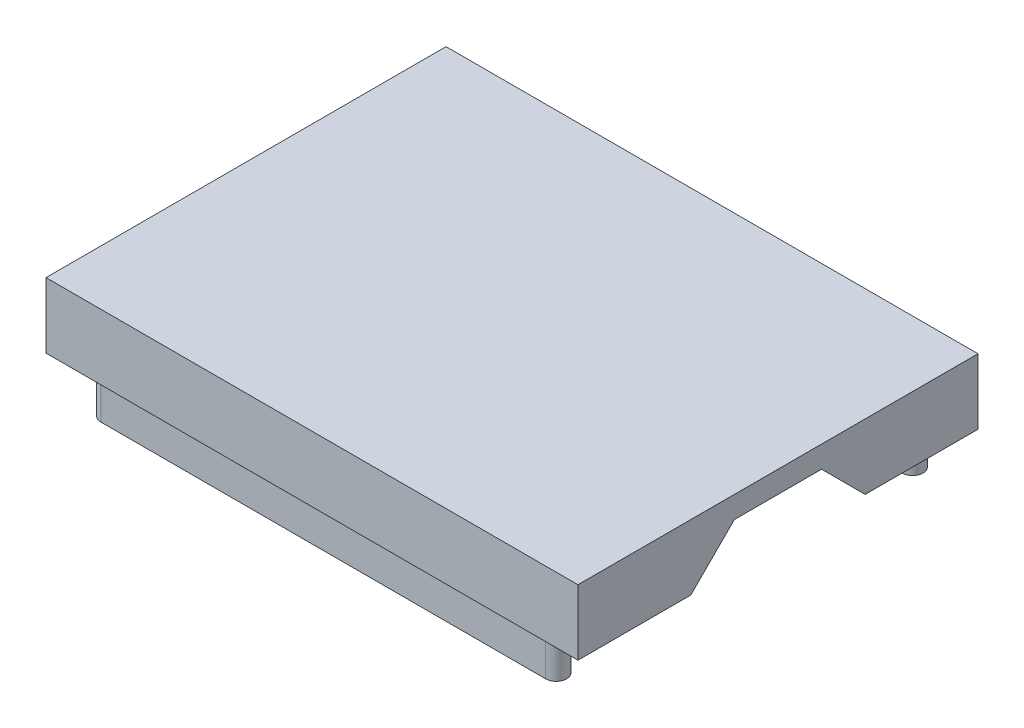
ISO-10303-21;
HEADER;
FILE_DESCRIPTION(('STEP AP214'),'2;1');
FILE_NAME('part.step','',(''),(''),'','','');
FILE_SCHEMA(('AUTOMOTIVE_DESIGN { 1 0 10303 214 1 1 1 1 }'));
ENDSEC;
DATA;
#1=APPLICATION_CONTEXT('core data for automotive mechanical design processes');
#2=APPLICATION_PROTOCOL_DEFINITION('international standard','automotive_design',2000,#1);
#3=PRODUCT_CONTEXT('',#1,'mechanical');
#4=PRODUCT('Part','Part','',(#3));
#5=PRODUCT_RELATED_PRODUCT_CATEGORY('part','',(#4));
#6=PRODUCT_DEFINITION_FORMATION('','',#4);
#7=PRODUCT_DEFINITION_CONTEXT('part definition',#1,'design');
#8=PRODUCT_DEFINITION('design','',#6,#7);
#9=PRODUCT_DEFINITION_SHAPE('','',#8);
#10=(LENGTH_UNIT() NAMED_UNIT(*) SI_UNIT(.MILLI.,.METRE.));
#11=(NAMED_UNIT(*) PLANE_ANGLE_UNIT() SI_UNIT($,.RADIAN.));
#12=(NAMED_UNIT(*) SI_UNIT($,.STERADIAN.) SOLID_ANGLE_UNIT());
#13=UNCERTAINTY_MEASURE_WITH_UNIT(LENGTH_MEASURE(1.E-05),#10,'distance_accuracy_value','');
#14=(GEOMETRIC_REPRESENTATION_CONTEXT(3) GLOBAL_UNCERTAINTY_ASSIGNED_CONTEXT((#13)) GLOBAL_UNIT_ASSIGNED_CONTEXT((#10,
#11,#12)) REPRESENTATION_CONTEXT('',''));
#15=CARTESIAN_POINT('',(0.,0.,0.));
#16=DIRECTION('',(0.,0.,1.));
#17=DIRECTION('',(1.,0.,0.));
#18=AXIS2_PLACEMENT_3D('',#15,#16,#17);
#19=CARTESIAN_POINT('',(1.27,0.,-6.57225));
#20=DIRECTION('',(0.,0.707106781186547,0.707106781186548));
#21=DIRECTION('',(0.,-0.707106781186548,0.707106781186547));
#22=AXIS2_PLACEMENT_3D('',#19,#20,#21);
#23=PLANE('',#22);
#24=DIRECTION('',(1.,0.,0.));
#25=VECTOR('',#24,1.);
#26=CARTESIAN_POINT('',(1.27,2.54,-9.11225));
#27=LINE('',#26,#25);
#28=CARTESIAN_POINT('',(1.27,2.54,-9.11225));
#29=VERTEX_POINT('',#28);
#30=CARTESIAN_POINT('',(2.54,2.54,-9.11225));
#31=VERTEX_POINT('',#30);
#32=EDGE_CURVE('E334',#29,#31,#27,.T.);
#33=ORIENTED_EDGE('',*,*,#32,.T.);
#34=DIRECTION('',(0.,-0.707106781186548,0.707106781186547));
#35=VECTOR('',#34,1.);
#36=CARTESIAN_POINT('',(2.54,0.,-6.57225));
#37=LINE('',#36,#35);
#38=CARTESIAN_POINT('',(2.54,0.,-6.57225));
#39=VERTEX_POINT('',#38);
#40=EDGE_CURVE('E247',#31,#39,#37,.T.);
#41=ORIENTED_EDGE('',*,*,#40,.T.);
#42=DIRECTION('',(1.,0.,0.));
#43=VECTOR('',#42,1.);
#44=CARTESIAN_POINT('',(1.27,0.,-6.57225));
#45=LINE('',#44,#43);
#46=CARTESIAN_POINT('',(1.27,0.,-6.57225));
#47=VERTEX_POINT('',#46);
#48=EDGE_CURVE('E329',#47,#39,#45,.T.);
#49=ORIENTED_EDGE('',*,*,#48,.F.);
#50=DIRECTION('',(0.,-0.707106781186548,0.707106781186547));
#51=VECTOR('',#50,1.);
#52=CARTESIAN_POINT('',(1.27,0.,-6.57225));
#53=LINE('',#52,#51);
#54=EDGE_CURVE('E319',#29,#47,#53,.T.);
#55=ORIENTED_EDGE('',*,*,#54,.F.);
#56=EDGE_LOOP('',(#33,#41,#49,#55));
#57=FACE_BOUND('',#56,.T.);
#58=ADVANCED_FACE('F41',(#57),#23,.F.);
#59=CARTESIAN_POINT('',(1.27,2.54,-14.19225));
#60=DIRECTION('',(0.,0.707106781186548,-0.707106781186547));
#61=DIRECTION('',(0.,0.707106781186547,0.707106781186548));
#62=AXIS2_PLACEMENT_3D('',#59,#60,#61);
#63=PLANE('',#62);
#64=DIRECTION('',(1.,0.,0.));
#65=VECTOR('',#64,1.);
#66=CARTESIAN_POINT('',(1.27,0.,-16.73225));
#67=LINE('',#66,#65);
#68=CARTESIAN_POINT('',(1.27,0.,-16.73225));
#69=VERTEX_POINT('',#68);
#70=CARTESIAN_POINT('',(2.54,0.,-16.73225));
#71=VERTEX_POINT('',#70);
#72=EDGE_CURVE('E340',#69,#71,#67,.T.);
#73=ORIENTED_EDGE('',*,*,#72,.T.);
#74=DIRECTION('',(0.,0.707106781186547,0.707106781186548));
#75=VECTOR('',#74,1.);
#76=CARTESIAN_POINT('',(2.54,2.54,-14.19225));
#77=LINE('',#76,#75);
#78=CARTESIAN_POINT('',(2.54,2.54,-14.19225));
#79=VERTEX_POINT('',#78);
#80=EDGE_CURVE('E11',#71,#79,#77,.T.);
#81=ORIENTED_EDGE('',*,*,#80,.T.);
#82=DIRECTION('',(1.,0.,0.));
#83=VECTOR('',#82,1.);
#84=CARTESIAN_POINT('',(1.27,2.54,-14.19225));
#85=LINE('',#84,#83);
#86=CARTESIAN_POINT('',(1.27,2.54,-14.19225));
#87=VERTEX_POINT('',#86);
#88=EDGE_CURVE('E208',#87,#79,#85,.T.);
#89=ORIENTED_EDGE('',*,*,#88,.F.);
#90=DIRECTION('',(0.,0.707106781186547,0.707106781186548));
#91=VECTOR('',#90,1.);
#92=CARTESIAN_POINT('',(1.27,2.54,-14.19225));
#93=LINE('',#92,#91);
#94=EDGE_CURVE('E312',#69,#87,#93,.T.);
#95=ORIENTED_EDGE('',*,*,#94,.F.);
#96=EDGE_LOOP('',(#73,#81,#89,#95));
#97=FACE_BOUND('',#96,.T.);
#98=ADVANCED_FACE('F426',(#97),#63,.F.);
#99=CARTESIAN_POINT('',(0.,0.,0.));
#100=DIRECTION('',(0.,-1.,0.));
#101=DIRECTION('',(0.,0.,-1.));
#102=AXIS2_PLACEMENT_3D('',#99,#100,#101);
#103=PLANE('',#102);
#104=DIRECTION('',(0.,0.,-1.));
#105=VECTOR('',#104,1.);
#106=CARTESIAN_POINT('',(2.54,0.,-20.7645));
#107=LINE('',#106,#105);
#108=CARTESIAN_POINT('',(2.54,0.,-2.54));
#109=VERTEX_POINT('',#108);
#110=EDGE_CURVE('E229',#109,#39,#107,.T.);
#111=ORIENTED_EDGE('',*,*,#110,.F.);
#112=DIRECTION('',(-1.,0.,0.));
#113=VECTOR('',#112,1.);
#114=CARTESIAN_POINT('',(2.54,0.,-2.54));
#115=LINE('',#114,#113);
#116=CARTESIAN_POINT('',(28.448,0.,-2.54));
#117=VERTEX_POINT('',#116);
#118=EDGE_CURVE('E210',#117,#109,#115,.T.);
#119=ORIENTED_EDGE('',*,*,#118,.F.);
#120=DIRECTION('',(0.,0.,1.));
#121=VECTOR('',#120,1.);
#122=CARTESIAN_POINT('',(28.448,0.,-20.7645));
#123=LINE('',#122,#121);
#124=CARTESIAN_POINT('',(28.448,0.,-6.57225));
#125=VERTEX_POINT('',#124);
#126=EDGE_CURVE('E233',#125,#117,#123,.T.);
#127=ORIENTED_EDGE('',*,*,#126,.F.);
#128=CARTESIAN_POINT('',(30.988,0.,-6.57225));
#129=VERTEX_POINT('',#128);
#130=EDGE_CURVE('E333',#125,#129,#45,.T.);
#131=ORIENTED_EDGE('',*,*,#130,.T.);
#132=DIRECTION('',(0.,0.,-1.));
#133=VECTOR('',#132,1.);
#134=CARTESIAN_POINT('',(30.988,0.,0.));
#135=LINE('',#134,#133);
#136=CARTESIAN_POINT('',(30.988,0.,0.));
#137=VERTEX_POINT('',#136);
#138=EDGE_CURVE('E359',#137,#129,#135,.T.);
#139=ORIENTED_EDGE('',*,*,#138,.F.);
#140=DIRECTION('',(1.,0.,0.));
#141=VECTOR('',#140,1.);
#142=CARTESIAN_POINT('',(0.,0.,0.));
#143=LINE('',#142,#141);
#144=CARTESIAN_POINT('',(0.,0.,0.));
#145=VERTEX_POINT('',#144);
#146=EDGE_CURVE('E356',#145,#137,#143,.T.);
#147=ORIENTED_EDGE('',*,*,#146,.F.);
#148=DIRECTION('',(0.,0.,1.));
#149=VECTOR('',#148,1.);
#150=CARTESIAN_POINT('',(0.,0.,0.));
#151=LINE('',#150,#149);
#152=CARTESIAN_POINT('',(0.,0.,-23.3045));
#153=VERTEX_POINT('',#152);
#154=EDGE_CURVE('E332',#153,#145,#151,.T.);
#155=ORIENTED_EDGE('',*,*,#154,.F.);
#156=DIRECTION('',(-1.,0.,0.));
#157=VECTOR('',#156,1.);
#158=CARTESIAN_POINT('',(0.,0.,-23.3045));
#159=LINE('',#158,#157);
#160=CARTESIAN_POINT('',(30.988,0.,-23.3045));
#161=VERTEX_POINT('',#160);
#162=EDGE_CURVE('E347',#161,#153,#159,.T.);
#163=ORIENTED_EDGE('',*,*,#162,.F.);
#164=CARTESIAN_POINT('',(30.988,0.,-16.73225));
#165=VERTEX_POINT('',#164);
#166=EDGE_CURVE('E358',#165,#161,#135,.T.);
#167=ORIENTED_EDGE('',*,*,#166,.F.);
#168=CARTESIAN_POINT('',(28.448,0.,-16.73225));
#169=VERTEX_POINT('',#168);
#170=EDGE_CURVE('E321',#169,#165,#67,.T.);
#171=ORIENTED_EDGE('',*,*,#170,.F.);
#172=CARTESIAN_POINT('',(28.448,0.,-20.7645));
#173=VERTEX_POINT('',#172);
#174=EDGE_CURVE('E234',#173,#169,#123,.T.);
#175=ORIENTED_EDGE('',*,*,#174,.F.);
#176=DIRECTION('',(1.,0.,0.));
#177=VECTOR('',#176,1.);
#178=CARTESIAN_POINT('',(2.54,0.,-20.7645));
#179=LINE('',#178,#177);
#180=CARTESIAN_POINT('',(2.54,0.,-20.7645));
#181=VERTEX_POINT('',#180);
#182=EDGE_CURVE('E231',#181,#173,#179,.T.);
#183=ORIENTED_EDGE('',*,*,#182,.F.);
#184=EDGE_CURVE('E216',#71,#181,#107,.T.);
#185=ORIENTED_EDGE('',*,*,#184,.F.);
#186=ORIENTED_EDGE('',*,*,#72,.F.);
#187=DIRECTION('',(0.,0.,-1.));
#188=VECTOR('',#187,1.);
#189=CARTESIAN_POINT('',(1.27,0.,-6.57225));
#190=LINE('',#189,#188);
#191=EDGE_CURVE('E309',#47,#69,#190,.T.);
#192=ORIENTED_EDGE('',*,*,#191,.F.);
#193=ORIENTED_EDGE('',*,*,#48,.T.);
#194=EDGE_LOOP('',(#111,#119,#127,#131,#139,#147,#155,#163,#167,#171,#175,#183,#185,#186,#192,#193));
#195=FACE_BOUND('',#194,.T.);
#196=DIRECTION('',(1.,0.,0.));
#197=VECTOR('',#196,1.);
#198=CARTESIAN_POINT('',(2.54,0.,-1.8796));
#199=LINE('',#198,#197);
#200=CARTESIAN_POINT('',(2.54,0.,-1.8796));
#201=VERTEX_POINT('',#200);
#202=CARTESIAN_POINT('',(28.448,0.,-1.8796));
#203=VERTEX_POINT('',#202);
#204=EDGE_CURVE('E293',#201,#203,#199,.T.);
#205=ORIENTED_EDGE('',*,*,#204,.F.);
#206=CARTESIAN_POINT('',(2.54,0.,-1.27));
#207=DIRECTION('',(0.,-1.,0.));
#208=DIRECTION('',(0.,0.,-1.));
#209=AXIS2_PLACEMENT_3D('',#206,#207,#208);
#210=CIRCLE('',#209,0.6096);
#211=CARTESIAN_POINT('',(2.54,0.,-0.6604));
#212=VERTEX_POINT('',#211);
#213=EDGE_CURVE('E272',#212,#201,#210,.T.);
#214=ORIENTED_EDGE('',*,*,#213,.F.);
#215=DIRECTION('',(-1.,0.,0.));
#216=VECTOR('',#215,1.);
#217=CARTESIAN_POINT('',(2.54,0.,-0.6604));
#218=LINE('',#217,#216);
#219=CARTESIAN_POINT('',(28.448,0.,-0.6604));
#220=VERTEX_POINT('',#219);
#221=EDGE_CURVE('E284',#220,#212,#218,.T.);
#222=ORIENTED_EDGE('',*,*,#221,.F.);
#223=CARTESIAN_POINT('',(28.448,0.,-1.27));
#224=DIRECTION('',(0.,-1.,0.));
#225=DIRECTION('',(0.,0.,-1.));
#226=AXIS2_PLACEMENT_3D('',#223,#224,#225);
#227=CIRCLE('',#226,0.6096);
#228=EDGE_CURVE('E295',#203,#220,#227,.T.);
#229=ORIENTED_EDGE('',*,*,#228,.F.);
#230=EDGE_LOOP('',(#205,#214,#222,#229));
#231=FACE_BOUND('',#230,.T.);
#232=DIRECTION('',(1.,0.,0.));
#233=VECTOR('',#232,1.);
#234=CARTESIAN_POINT('',(2.54,0.,-22.6441));
#235=LINE('',#234,#233);
#236=CARTESIAN_POINT('',(2.54,0.,-22.6441));
#237=VERTEX_POINT('',#236);
#238=CARTESIAN_POINT('',(28.448,0.,-22.6441));
#239=VERTEX_POINT('',#238);
#240=EDGE_CURVE('E267',#237,#239,#235,.T.);
#241=ORIENTED_EDGE('',*,*,#240,.F.);
#242=CARTESIAN_POINT('',(2.54,0.,-22.0345));
#243=DIRECTION('',(0.,-1.,0.));
#244=DIRECTION('',(0.,0.,-1.));
#245=AXIS2_PLACEMENT_3D('',#242,#243,#244);
#246=CIRCLE('',#245,0.609600000000005);
#247=CARTESIAN_POINT('',(2.54,0.,-21.4249));
#248=VERTEX_POINT('',#247);
#249=EDGE_CURVE('E269',#248,#237,#246,.T.);
#250=ORIENTED_EDGE('',*,*,#249,.F.);
#251=DIRECTION('',(-1.,0.,0.));
#252=VECTOR('',#251,1.);
#253=CARTESIAN_POINT('',(2.54,0.,-21.4249));
#254=LINE('',#253,#252);
#255=CARTESIAN_POINT('',(28.448,0.,-21.4249));
#256=VERTEX_POINT('',#255);
#257=EDGE_CURVE('E261',#256,#248,#254,.T.);
#258=ORIENTED_EDGE('',*,*,#257,.F.);
#259=CARTESIAN_POINT('',(28.448,0.,-22.0345));
#260=DIRECTION('',(0.,-1.,0.));
#261=DIRECTION('',(0.,0.,-1.));
#262=AXIS2_PLACEMENT_3D('',#259,#260,#261);
#263=CIRCLE('',#262,0.609600000000005);
#264=EDGE_CURVE('E263',#239,#256,#263,.T.);
#265=ORIENTED_EDGE('',*,*,#264,.F.);
#266=EDGE_LOOP('',(#241,#250,#258,#265));
#267=FACE_BOUND('',#266,.T.);
#268=ADVANCED_FACE('F384',(#195,#231,#267),#103,.T.);
#269=CARTESIAN_POINT('',(0.,3.81,0.));
#270=DIRECTION('',(1.,0.,0.));
#271=DIRECTION('',(0.,0.,-1.));
#272=AXIS2_PLACEMENT_3D('',#269,#270,#271);
#273=PLANE('',#272);
#274=ORIENTED_EDGE('',*,*,#154,.T.);
#275=DIRECTION('',(0.,-1.,0.));
#276=VECTOR('',#275,1.);
#277=CARTESIAN_POINT('',(0.,3.81,0.));
#278=LINE('',#277,#276);
#279=CARTESIAN_POINT('',(0.,3.81,0.));
#280=VERTEX_POINT('',#279);
#281=EDGE_CURVE('E371',#280,#145,#278,.T.);
#282=ORIENTED_EDGE('',*,*,#281,.F.);
#283=DIRECTION('',(0.,0.,1.));
#284=VECTOR('',#283,1.);
#285=CARTESIAN_POINT('',(0.,3.81,0.));
#286=LINE('',#285,#284);
#287=CARTESIAN_POINT('',(0.,3.81,-23.3045));
#288=VERTEX_POINT('',#287);
#289=EDGE_CURVE('E343',#288,#280,#286,.T.);
#290=ORIENTED_EDGE('',*,*,#289,.F.);
#291=DIRECTION('',(0.,-1.,0.));
#292=VECTOR('',#291,1.);
#293=CARTESIAN_POINT('',(0.,3.81,-23.3045));
#294=LINE('',#293,#292);
#295=EDGE_CURVE('E353',#288,#153,#294,.T.);
#296=ORIENTED_EDGE('',*,*,#295,.T.);
#297=EDGE_LOOP('',(#274,#282,#290,#296));
#298=FACE_BOUND('',#297,.T.);
#299=ADVANCED_FACE('F43',(#298),#273,.F.);
#300=CARTESIAN_POINT('',(0.,3.81,0.));
#301=DIRECTION('',(0.,0.,-1.));
#302=DIRECTION('',(-1.,0.,0.));
#303=AXIS2_PLACEMENT_3D('',#300,#301,#302);
#304=PLANE('',#303);
#305=ORIENTED_EDGE('',*,*,#146,.T.);
#306=DIRECTION('',(0.,-1.,0.));
#307=VECTOR('',#306,1.);
#308=CARTESIAN_POINT('',(30.988,3.81,0.));
#309=LINE('',#308,#307);
#310=CARTESIAN_POINT('',(30.988,3.81,0.));
#311=VERTEX_POINT('',#310);
#312=EDGE_CURVE('E368',#311,#137,#309,.T.);
#313=ORIENTED_EDGE('',*,*,#312,.F.);
#314=DIRECTION('',(1.,0.,0.));
#315=VECTOR('',#314,1.);
#316=CARTESIAN_POINT('',(0.,3.81,0.));
#317=LINE('',#316,#315);
#318=EDGE_CURVE('E346',#280,#311,#317,.T.);
#319=ORIENTED_EDGE('',*,*,#318,.F.);
#320=ORIENTED_EDGE('',*,*,#281,.T.);
#321=EDGE_LOOP('',(#305,#313,#319,#320));
#322=FACE_BOUND('',#321,.T.);
#323=ADVANCED_FACE('F643',(#322),#304,.F.);
#324=CARTESIAN_POINT('',(30.988,3.81,0.));
#325=DIRECTION('',(-1.,0.,0.));
#326=DIRECTION('',(0.,0.,1.));
#327=AXIS2_PLACEMENT_3D('',#324,#325,#326);
#328=PLANE('',#327);
#329=ORIENTED_EDGE('',*,*,#138,.T.);
#330=DIRECTION('',(0.,-0.707106781186548,0.707106781186547));
#331=VECTOR('',#330,1.);
#332=CARTESIAN_POINT('',(30.988,0.,-6.57225));
#333=LINE('',#332,#331);
#334=CARTESIAN_POINT('',(30.988,2.54,-9.11225));
#335=VERTEX_POINT('',#334);
#336=EDGE_CURVE('E313',#335,#129,#333,.T.);
#337=ORIENTED_EDGE('',*,*,#336,.F.);
#338=DIRECTION('',(0.,0.,1.));
#339=VECTOR('',#338,1.);
#340=CARTESIAN_POINT('',(30.988,2.54,-9.11225));
#341=LINE('',#340,#339);
#342=CARTESIAN_POINT('',(30.988,2.54,-14.19225));
#343=VERTEX_POINT('',#342);
#344=EDGE_CURVE('E324',#343,#335,#341,.T.);
#345=ORIENTED_EDGE('',*,*,#344,.F.);
#346=DIRECTION('',(0.,0.707106781186547,0.707106781186548));
#347=VECTOR('',#346,1.);
#348=CARTESIAN_POINT('',(30.988,2.54,-14.19225));
#349=LINE('',#348,#347);
#350=EDGE_CURVE('E308',#165,#343,#349,.T.);
#351=ORIENTED_EDGE('',*,*,#350,.F.);
#352=ORIENTED_EDGE('',*,*,#166,.T.);
#353=DIRECTION('',(0.,-1.,0.));
#354=VECTOR('',#353,1.);
#355=CARTESIAN_POINT('',(30.988,3.81,-23.3045));
#356=LINE('',#355,#354);
#357=CARTESIAN_POINT('',(30.988,3.81,-23.3045));
#358=VERTEX_POINT('',#357);
#359=EDGE_CURVE('E365',#358,#161,#356,.T.);
#360=ORIENTED_EDGE('',*,*,#359,.F.);
#361=DIRECTION('',(0.,0.,-1.));
#362=VECTOR('',#361,1.);
#363=CARTESIAN_POINT('',(30.988,3.81,0.));
#364=LINE('',#363,#362);
#365=EDGE_CURVE('E349',#311,#358,#364,.T.);
#366=ORIENTED_EDGE('',*,*,#365,.F.);
#367=ORIENTED_EDGE('',*,*,#312,.T.);
#368=EDGE_LOOP('',(#329,#337,#345,#351,#352,#360,#366,#367));
#369=FACE_BOUND('',#368,.T.);
#370=ADVANCED_FACE('F390',(#369),#328,.F.);
#371=CARTESIAN_POINT('',(0.,3.81,-23.3045));
#372=DIRECTION('',(0.,0.,1.));
#373=DIRECTION('',(1.,0.,0.));
#374=AXIS2_PLACEMENT_3D('',#371,#372,#373);
#375=PLANE('',#374);
#376=ORIENTED_EDGE('',*,*,#162,.T.);
#377=ORIENTED_EDGE('',*,*,#295,.F.);
#378=DIRECTION('',(-1.,0.,0.));
#379=VECTOR('',#378,1.);
#380=CARTESIAN_POINT('',(0.,3.81,-23.3045));
#381=LINE('',#380,#379);
#382=EDGE_CURVE('E351',#358,#288,#381,.T.);
#383=ORIENTED_EDGE('',*,*,#382,.F.);
#384=ORIENTED_EDGE('',*,*,#359,.T.);
#385=EDGE_LOOP('',(#376,#377,#383,#384));
#386=FACE_BOUND('',#385,.T.);
#387=ADVANCED_FACE('F395',(#386),#375,.F.);
#388=CARTESIAN_POINT('',(0.,3.81,0.));
#389=DIRECTION('',(0.,-1.,0.));
#390=DIRECTION('',(0.,0.,-1.));
#391=AXIS2_PLACEMENT_3D('',#388,#389,#390);
#392=PLANE('',#391);
#393=ORIENTED_EDGE('',*,*,#289,.T.);
#394=ORIENTED_EDGE('',*,*,#318,.T.);
#395=ORIENTED_EDGE('',*,*,#365,.T.);
#396=ORIENTED_EDGE('',*,*,#382,.T.);
#397=EDGE_LOOP('',(#393,#394,#395,#396));
#398=FACE_BOUND('',#397,.T.);
#399=ADVANCED_FACE('F399',(#398),#392,.F.);
#400=ORIENTED_EDGE('',*,*,#130,.F.);
#401=DIRECTION('',(0.,0.707106781186548,-0.707106781186547));
#402=VECTOR('',#401,1.);
#403=CARTESIAN_POINT('',(28.448,0.,-6.57225));
#404=LINE('',#403,#402);
#405=CARTESIAN_POINT('',(28.448,2.54,-9.11225));
#406=VERTEX_POINT('',#405);
#407=EDGE_CURVE('E240',#125,#406,#404,.T.);
#408=ORIENTED_EDGE('',*,*,#407,.T.);
#409=EDGE_CURVE('E337',#406,#335,#27,.T.);
#410=ORIENTED_EDGE('',*,*,#409,.T.);
#411=ORIENTED_EDGE('',*,*,#336,.T.);
#412=EDGE_LOOP('',(#400,#408,#410,#411));
#413=FACE_BOUND('',#412,.T.);
#414=ADVANCED_FACE('F409',(#413),#23,.F.);
#415=CARTESIAN_POINT('',(1.27,2.54,-9.11225));
#416=DIRECTION('',(0.,1.,0.));
#417=DIRECTION('',(0.,0.,1.));
#418=AXIS2_PLACEMENT_3D('',#415,#416,#417);
#419=PLANE('',#418);
#420=ORIENTED_EDGE('',*,*,#409,.F.);
#421=DIRECTION('',(0.,0.,1.));
#422=VECTOR('',#421,1.);
#423=CARTESIAN_POINT('',(28.448,2.54,-20.7645));
#424=LINE('',#423,#422);
#425=CARTESIAN_POINT('',(28.448,2.54,-2.54));
#426=VERTEX_POINT('',#425);
#427=EDGE_CURVE('E224',#406,#426,#424,.T.);
#428=ORIENTED_EDGE('',*,*,#427,.T.);
#429=DIRECTION('',(-1.,0.,0.));
#430=VECTOR('',#429,1.);
#431=CARTESIAN_POINT('',(2.54,2.54,-2.54));
#432=LINE('',#431,#430);
#433=CARTESIAN_POINT('',(2.54,2.54,-2.54));
#434=VERTEX_POINT('',#433);
#435=EDGE_CURVE('E221',#426,#434,#432,.T.);
#436=ORIENTED_EDGE('',*,*,#435,.T.);
#437=DIRECTION('',(0.,0.,-1.));
#438=VECTOR('',#437,1.);
#439=CARTESIAN_POINT('',(2.54,2.54,-20.7645));
#440=LINE('',#439,#438);
#441=EDGE_CURVE('E56',#434,#31,#440,.T.);
#442=ORIENTED_EDGE('',*,*,#441,.T.);
#443=ORIENTED_EDGE('',*,*,#32,.F.);
#444=DIRECTION('',(0.,0.,1.));
#445=VECTOR('',#444,1.);
#446=CARTESIAN_POINT('',(1.27,2.54,-9.11225));
#447=LINE('',#446,#445);
#448=EDGE_CURVE('E316',#87,#29,#447,.T.);
#449=ORIENTED_EDGE('',*,*,#448,.F.);
#450=ORIENTED_EDGE('',*,*,#88,.T.);
#451=CARTESIAN_POINT('',(2.54,2.54,-20.7645));
#452=VERTEX_POINT('',#451);
#453=EDGE_CURVE('E201',#79,#452,#440,.T.);
#454=ORIENTED_EDGE('',*,*,#453,.T.);
#455=DIRECTION('',(1.,0.,0.));
#456=VECTOR('',#455,1.);
#457=CARTESIAN_POINT('',(2.54,2.54,-20.7645));
#458=LINE('',#457,#456);
#459=CARTESIAN_POINT('',(28.448,2.54,-20.7645));
#460=VERTEX_POINT('',#459);
#461=EDGE_CURVE('E206',#452,#460,#458,.T.);
#462=ORIENTED_EDGE('',*,*,#461,.T.);
#463=CARTESIAN_POINT('',(28.448,2.54,-14.19225));
#464=VERTEX_POINT('',#463);
#465=EDGE_CURVE('E63',#460,#464,#424,.T.);
#466=ORIENTED_EDGE('',*,*,#465,.T.);
#467=EDGE_CURVE('E339',#464,#343,#85,.T.);
#468=ORIENTED_EDGE('',*,*,#467,.T.);
#469=ORIENTED_EDGE('',*,*,#344,.T.);
#470=EDGE_LOOP('',(#420,#428,#436,#442,#443,#449,#450,#454,#462,#466,#468,#469));
#471=FACE_BOUND('',#470,.T.);
#472=ADVANCED_FACE('F204',(#471),#419,.F.);
#473=ORIENTED_EDGE('',*,*,#467,.F.);
#474=DIRECTION('',(0.,-0.707106781186547,-0.707106781186548));
#475=VECTOR('',#474,1.);
#476=CARTESIAN_POINT('',(28.448,2.54,-14.19225));
#477=LINE('',#476,#475);
#478=EDGE_CURVE('E49',#464,#169,#477,.T.);
#479=ORIENTED_EDGE('',*,*,#478,.T.);
#480=ORIENTED_EDGE('',*,*,#170,.T.);
#481=ORIENTED_EDGE('',*,*,#350,.T.);
#482=EDGE_LOOP('',(#473,#479,#480,#481));
#483=FACE_BOUND('',#482,.T.);
#484=ADVANCED_FACE('F377',(#483),#63,.F.);
#485=CARTESIAN_POINT('',(1.27,0.,0.));
#486=DIRECTION('',(-1.,0.,0.));
#487=DIRECTION('',(0.,0.,1.));
#488=AXIS2_PLACEMENT_3D('',#485,#486,#487);
#489=PLANE('',#488);
#490=ORIENTED_EDGE('',*,*,#191,.T.);
#491=ORIENTED_EDGE('',*,*,#94,.T.);
#492=ORIENTED_EDGE('',*,*,#448,.T.);
#493=ORIENTED_EDGE('',*,*,#54,.T.);
#494=EDGE_LOOP('',(#490,#491,#492,#493));
#495=FACE_BOUND('',#494,.T.);
#496=ADVANCED_FACE('F422',(#495),#489,.F.);
#497=CARTESIAN_POINT('',(2.54,-2.54,-1.27));
#498=DIRECTION('',(0.,1.,0.));
#499=DIRECTION('',(0.,0.,1.));
#500=AXIS2_PLACEMENT_3D('',#497,#498,#499);
#501=CYLINDRICAL_SURFACE('',#500,0.6096);
#502=ORIENTED_EDGE('',*,*,#213,.T.);
#503=DIRECTION('',(0.,1.,0.));
#504=VECTOR('',#503,1.);
#505=CARTESIAN_POINT('',(2.54,-2.54,-1.8796));
#506=LINE('',#505,#504);
#507=CARTESIAN_POINT('',(2.54,-2.54,-1.8796));
#508=VERTEX_POINT('',#507);
#509=EDGE_CURVE('E306',#508,#201,#506,.T.);
#510=ORIENTED_EDGE('',*,*,#509,.F.);
#511=CARTESIAN_POINT('',(2.54,-2.54,-1.27));
#512=DIRECTION('',(0.,-1.,0.));
#513=DIRECTION('',(0.,0.,-1.));
#514=AXIS2_PLACEMENT_3D('',#511,#512,#513);
#515=CIRCLE('',#514,0.6096);
#516=CARTESIAN_POINT('',(2.54,-2.54,-0.6604));
#517=VERTEX_POINT('',#516);
#518=EDGE_CURVE('E280',#517,#508,#515,.T.);
#519=ORIENTED_EDGE('',*,*,#518,.F.);
#520=DIRECTION('',(0.,1.,0.));
#521=VECTOR('',#520,1.);
#522=CARTESIAN_POINT('',(2.54,-2.54,-0.6604));
#523=LINE('',#522,#521);
#524=EDGE_CURVE('E290',#517,#212,#523,.T.);
#525=ORIENTED_EDGE('',*,*,#524,.T.);
#526=EDGE_LOOP('',(#502,#510,#519,#525));
#527=FACE_BOUND('',#526,.T.);
#528=ADVANCED_FACE('F443',(#527),#501,.T.);
#529=CARTESIAN_POINT('',(2.54,-2.54,-1.8796));
#530=DIRECTION('',(0.,0.,1.));
#531=DIRECTION('',(1.,0.,0.));
#532=AXIS2_PLACEMENT_3D('',#529,#530,#531);
#533=PLANE('',#532);
#534=ORIENTED_EDGE('',*,*,#204,.T.);
#535=DIRECTION('',(0.,1.,0.));
#536=VECTOR('',#535,1.);
#537=CARTESIAN_POINT('',(28.448,-2.54,-1.8796));
#538=LINE('',#537,#536);
#539=CARTESIAN_POINT('',(28.448,-2.54,-1.8796));
#540=VERTEX_POINT('',#539);
#541=EDGE_CURVE('E303',#540,#203,#538,.T.);
#542=ORIENTED_EDGE('',*,*,#541,.F.);
#543=DIRECTION('',(1.,0.,0.));
#544=VECTOR('',#543,1.);
#545=CARTESIAN_POINT('',(2.54,-2.54,-1.8796));
#546=LINE('',#545,#544);
#547=EDGE_CURVE('E283',#508,#540,#546,.T.);
#548=ORIENTED_EDGE('',*,*,#547,.F.);
#549=ORIENTED_EDGE('',*,*,#509,.T.);
#550=EDGE_LOOP('',(#534,#542,#548,#549));
#551=FACE_BOUND('',#550,.T.);
#552=ADVANCED_FACE('F451',(#551),#533,.F.);
#553=CARTESIAN_POINT('',(28.448,-2.54,-1.27));
#554=DIRECTION('',(0.,1.,0.));
#555=DIRECTION('',(0.,0.,1.));
#556=AXIS2_PLACEMENT_3D('',#553,#554,#555);
#557=CYLINDRICAL_SURFACE('',#556,0.6096);
#558=ORIENTED_EDGE('',*,*,#228,.T.);
#559=DIRECTION('',(0.,1.,0.));
#560=VECTOR('',#559,1.);
#561=CARTESIAN_POINT('',(28.448,-2.54,-0.6604));
#562=LINE('',#561,#560);
#563=CARTESIAN_POINT('',(28.448,-2.54,-0.6604));
#564=VERTEX_POINT('',#563);
#565=EDGE_CURVE('E301',#564,#220,#562,.T.);
#566=ORIENTED_EDGE('',*,*,#565,.F.);
#567=CARTESIAN_POINT('',(28.448,-2.54,-1.27));
#568=DIRECTION('',(0.,-1.,0.));
#569=DIRECTION('',(0.,0.,-1.));
#570=AXIS2_PLACEMENT_3D('',#567,#568,#569);
#571=CIRCLE('',#570,0.6096);
#572=EDGE_CURVE('E286',#540,#564,#571,.T.);
#573=ORIENTED_EDGE('',*,*,#572,.F.);
#574=ORIENTED_EDGE('',*,*,#541,.T.);
#575=EDGE_LOOP('',(#558,#566,#573,#574));
#576=FACE_BOUND('',#575,.T.);
#577=ADVANCED_FACE('F455',(#576),#557,.T.);
#578=CARTESIAN_POINT('',(2.54,-2.54,-0.6604));
#579=DIRECTION('',(0.,0.,-1.));
#580=DIRECTION('',(-1.,0.,0.));
#581=AXIS2_PLACEMENT_3D('',#578,#579,#580);
#582=PLANE('',#581);
#583=ORIENTED_EDGE('',*,*,#221,.T.);
#584=ORIENTED_EDGE('',*,*,#524,.F.);
#585=DIRECTION('',(-1.,0.,0.));
#586=VECTOR('',#585,1.);
#587=CARTESIAN_POINT('',(2.54,-2.54,-0.6604));
#588=LINE('',#587,#586);
#589=EDGE_CURVE('E288',#564,#517,#588,.T.);
#590=ORIENTED_EDGE('',*,*,#589,.F.);
#591=ORIENTED_EDGE('',*,*,#565,.T.);
#592=EDGE_LOOP('',(#583,#584,#590,#591));
#593=FACE_BOUND('',#592,.T.);
#594=ADVANCED_FACE('F459',(#593),#582,.F.);
#595=CARTESIAN_POINT('',(2.54,-2.54,-1.27));
#596=DIRECTION('',(0.,-1.,0.));
#597=DIRECTION('',(0.,0.,-1.));
#598=AXIS2_PLACEMENT_3D('',#595,#596,#597);
#599=PLANE('',#598);
#600=ORIENTED_EDGE('',*,*,#518,.T.);
#601=ORIENTED_EDGE('',*,*,#547,.T.);
#602=ORIENTED_EDGE('',*,*,#572,.T.);
#603=ORIENTED_EDGE('',*,*,#589,.T.);
#604=EDGE_LOOP('',(#600,#601,#602,#603));
#605=FACE_BOUND('',#604,.T.);
#606=ADVANCED_FACE('F463',(#605),#599,.T.);
#607=CARTESIAN_POINT('',(2.54,-2.54,-22.0345));
#608=DIRECTION('',(0.,1.,0.));
#609=DIRECTION('',(0.,0.,1.));
#610=AXIS2_PLACEMENT_3D('',#607,#608,#609);
#611=CYLINDRICAL_SURFACE('',#610,0.609600000000005);
#612=ORIENTED_EDGE('',*,*,#249,.T.);
#613=DIRECTION('',(0.,1.,0.));
#614=VECTOR('',#613,1.);
#615=CARTESIAN_POINT('',(2.54,-2.54,-22.6441));
#616=LINE('',#615,#614);
#617=CARTESIAN_POINT('',(2.54,-2.54,-22.6441));
#618=VERTEX_POINT('',#617);
#619=EDGE_CURVE('E250',#618,#237,#616,.T.);
#620=ORIENTED_EDGE('',*,*,#619,.F.);
#621=CARTESIAN_POINT('',(2.54,-2.54,-22.0345));
#622=DIRECTION('',(0.,-1.,0.));
#623=DIRECTION('',(0.,0.,-1.));
#624=AXIS2_PLACEMENT_3D('',#621,#622,#623);
#625=CIRCLE('',#624,0.609600000000005);
#626=CARTESIAN_POINT('',(2.54,-2.54,-21.4249));
#627=VERTEX_POINT('',#626);
#628=EDGE_CURVE('E264',#627,#618,#625,.T.);
#629=ORIENTED_EDGE('',*,*,#628,.F.);
#630=DIRECTION('',(0.,1.,0.));
#631=VECTOR('',#630,1.);
#632=CARTESIAN_POINT('',(2.54,-2.54,-21.4249));
#633=LINE('',#632,#631);
#634=EDGE_CURVE('E257',#627,#248,#633,.T.);
#635=ORIENTED_EDGE('',*,*,#634,.T.);
#636=EDGE_LOOP('',(#612,#620,#629,#635));
#637=FACE_BOUND('',#636,.T.);
#638=ADVANCED_FACE('F467',(#637),#611,.T.);
#639=CARTESIAN_POINT('',(2.54,-2.54,-22.6441));
#640=DIRECTION('',(0.,0.,1.));
#641=DIRECTION('',(1.,0.,0.));
#642=AXIS2_PLACEMENT_3D('',#639,#640,#641);
#643=PLANE('',#642);
#644=ORIENTED_EDGE('',*,*,#240,.T.);
#645=DIRECTION('',(0.,1.,0.));
#646=VECTOR('',#645,1.);
#647=CARTESIAN_POINT('',(28.448,-2.54,-22.6441));
#648=LINE('',#647,#646);
#649=CARTESIAN_POINT('',(28.448,-2.54,-22.6441));
#650=VERTEX_POINT('',#649);
#651=EDGE_CURVE('E252',#650,#239,#648,.T.);
#652=ORIENTED_EDGE('',*,*,#651,.F.);
#653=DIRECTION('',(1.,0.,0.));
#654=VECTOR('',#653,1.);
#655=CARTESIAN_POINT('',(2.54,-2.54,-22.6441));
#656=LINE('',#655,#654);
#657=EDGE_CURVE('E276',#618,#650,#656,.T.);
#658=ORIENTED_EDGE('',*,*,#657,.F.);
#659=ORIENTED_EDGE('',*,*,#619,.T.);
#660=EDGE_LOOP('',(#644,#652,#658,#659));
#661=FACE_BOUND('',#660,.T.);
#662=ADVANCED_FACE('F481',(#661),#643,.F.);
#663=CARTESIAN_POINT('',(28.448,-2.54,-22.0345));
#664=DIRECTION('',(0.,1.,0.));
#665=DIRECTION('',(0.,0.,1.));
#666=AXIS2_PLACEMENT_3D('',#663,#664,#665);
#667=CYLINDRICAL_SURFACE('',#666,0.609600000000005);
#668=ORIENTED_EDGE('',*,*,#264,.T.);
#669=DIRECTION('',(0.,1.,0.));
#670=VECTOR('',#669,1.);
#671=CARTESIAN_POINT('',(28.448,-2.54,-21.4249));
#672=LINE('',#671,#670);
#673=CARTESIAN_POINT('',(28.448,-2.54,-21.4249));
#674=VERTEX_POINT('',#673);
#675=EDGE_CURVE('E255',#674,#256,#672,.T.);
#676=ORIENTED_EDGE('',*,*,#675,.F.);
#677=CARTESIAN_POINT('',(28.448,-2.54,-22.0345));
#678=DIRECTION('',(0.,-1.,0.));
#679=DIRECTION('',(0.,0.,-1.));
#680=AXIS2_PLACEMENT_3D('',#677,#678,#679);
#681=CIRCLE('',#680,0.609600000000005);
#682=EDGE_CURVE('E274',#650,#674,#681,.T.);
#683=ORIENTED_EDGE('',*,*,#682,.F.);
#684=ORIENTED_EDGE('',*,*,#651,.T.);
#685=EDGE_LOOP('',(#668,#676,#683,#684));
#686=FACE_BOUND('',#685,.T.);
#687=ADVANCED_FACE('F477',(#686),#667,.T.);
#688=CARTESIAN_POINT('',(2.54,-2.54,-21.4249));
#689=DIRECTION('',(0.,0.,-1.));
#690=DIRECTION('',(-1.,0.,0.));
#691=AXIS2_PLACEMENT_3D('',#688,#689,#690);
#692=PLANE('',#691);
#693=ORIENTED_EDGE('',*,*,#257,.T.);
#694=ORIENTED_EDGE('',*,*,#634,.F.);
#695=DIRECTION('',(-1.,0.,0.));
#696=VECTOR('',#695,1.);
#697=CARTESIAN_POINT('',(2.54,-2.54,-21.4249));
#698=LINE('',#697,#696);
#699=EDGE_CURVE('E260',#674,#627,#698,.T.);
#700=ORIENTED_EDGE('',*,*,#699,.F.);
#701=ORIENTED_EDGE('',*,*,#675,.T.);
#702=EDGE_LOOP('',(#693,#694,#700,#701));
#703=FACE_BOUND('',#702,.T.);
#704=ADVANCED_FACE('F473',(#703),#692,.F.);
#705=CARTESIAN_POINT('',(2.54,-2.54,-22.0345));
#706=DIRECTION('',(0.,-1.,0.));
#707=DIRECTION('',(0.,0.,-1.));
#708=AXIS2_PLACEMENT_3D('',#705,#706,#707);
#709=PLANE('',#708);
#710=ORIENTED_EDGE('',*,*,#628,.T.);
#711=ORIENTED_EDGE('',*,*,#657,.T.);
#712=ORIENTED_EDGE('',*,*,#682,.T.);
#713=ORIENTED_EDGE('',*,*,#699,.T.);
#714=EDGE_LOOP('',(#710,#711,#712,#713));
#715=FACE_BOUND('',#714,.T.);
#716=ADVANCED_FACE('F469',(#715),#709,.T.);
#717=CARTESIAN_POINT('',(28.448,2.54,-20.7645));
#718=DIRECTION('',(1.,0.,0.));
#719=DIRECTION('',(0.,0.,-1.));
#720=AXIS2_PLACEMENT_3D('',#717,#718,#719);
#721=PLANE('',#720);
#722=ORIENTED_EDGE('',*,*,#465,.F.);
#723=DIRECTION('',(0.,-1.,0.));
#724=VECTOR('',#723,1.);
#725=CARTESIAN_POINT('',(28.448,2.54,-20.7645));
#726=LINE('',#725,#724);
#727=EDGE_CURVE('E220',#460,#173,#726,.T.);
#728=ORIENTED_EDGE('',*,*,#727,.T.);
#729=ORIENTED_EDGE('',*,*,#174,.T.);
#730=ORIENTED_EDGE('',*,*,#478,.F.);
#731=EDGE_LOOP('',(#722,#728,#729,#730));
#732=FACE_BOUND('',#731,.T.);
#733=ADVANCED_FACE('F472',(#732),#721,.F.);
#734=CARTESIAN_POINT('',(2.54,2.54,-20.7645));
#735=DIRECTION('',(-1.,0.,0.));
#736=DIRECTION('',(0.,0.,1.));
#737=AXIS2_PLACEMENT_3D('',#734,#735,#736);
#738=PLANE('',#737);
#739=ORIENTED_EDGE('',*,*,#184,.T.);
#740=DIRECTION('',(0.,-1.,0.));
#741=VECTOR('',#740,1.);
#742=CARTESIAN_POINT('',(2.54,2.54,-20.7645));
#743=LINE('',#742,#741);
#744=EDGE_CURVE('E213',#452,#181,#743,.T.);
#745=ORIENTED_EDGE('',*,*,#744,.F.);
#746=ORIENTED_EDGE('',*,*,#453,.F.);
#747=ORIENTED_EDGE('',*,*,#80,.F.);
#748=EDGE_LOOP('',(#739,#745,#746,#747));
#749=FACE_BOUND('',#748,.T.);
#750=ADVANCED_FACE('F214',(#749),#738,.F.);
#751=CARTESIAN_POINT('',(2.54,2.54,-20.7645));
#752=DIRECTION('',(0.,0.,-1.));
#753=DIRECTION('',(-1.,0.,0.));
#754=AXIS2_PLACEMENT_3D('',#751,#752,#753);
#755=PLANE('',#754);
#756=ORIENTED_EDGE('',*,*,#182,.T.);
#757=ORIENTED_EDGE('',*,*,#727,.F.);
#758=ORIENTED_EDGE('',*,*,#461,.F.);
#759=ORIENTED_EDGE('',*,*,#744,.T.);
#760=EDGE_LOOP('',(#756,#757,#758,#759));
#761=FACE_BOUND('',#760,.T.);
#762=ADVANCED_FACE('F223',(#761),#755,.F.);
#763=ORIENTED_EDGE('',*,*,#441,.F.);
#764=DIRECTION('',(0.,-1.,0.));
#765=VECTOR('',#764,1.);
#766=CARTESIAN_POINT('',(2.54,2.54,-2.54));
#767=LINE('',#766,#765);
#768=EDGE_CURVE('E238',#434,#109,#767,.T.);
#769=ORIENTED_EDGE('',*,*,#768,.T.);
#770=ORIENTED_EDGE('',*,*,#110,.T.);
#771=ORIENTED_EDGE('',*,*,#40,.F.);
#772=EDGE_LOOP('',(#763,#769,#770,#771));
#773=FACE_BOUND('',#772,.T.);
#774=ADVANCED_FACE('F417',(#773),#738,.F.);
#775=ORIENTED_EDGE('',*,*,#126,.T.);
#776=DIRECTION('',(0.,-1.,0.));
#777=VECTOR('',#776,1.);
#778=CARTESIAN_POINT('',(28.448,2.54,-2.54));
#779=LINE('',#778,#777);
#780=EDGE_CURVE('E241',#426,#117,#779,.T.);
#781=ORIENTED_EDGE('',*,*,#780,.F.);
#782=ORIENTED_EDGE('',*,*,#427,.F.);
#783=ORIENTED_EDGE('',*,*,#407,.F.);
#784=EDGE_LOOP('',(#775,#781,#782,#783));
#785=FACE_BOUND('',#784,.T.);
#786=ADVANCED_FACE('F413',(#785),#721,.F.);
#787=CARTESIAN_POINT('',(2.54,2.54,-2.54));
#788=DIRECTION('',(0.,0.,1.));
#789=DIRECTION('',(1.,0.,0.));
#790=AXIS2_PLACEMENT_3D('',#787,#788,#789);
#791=PLANE('',#790);
#792=ORIENTED_EDGE('',*,*,#118,.T.);
#793=ORIENTED_EDGE('',*,*,#768,.F.);
#794=ORIENTED_EDGE('',*,*,#435,.F.);
#795=ORIENTED_EDGE('',*,*,#780,.T.);
#796=EDGE_LOOP('',(#792,#793,#794,#795));
#797=FACE_BOUND('',#796,.T.);
#798=ADVANCED_FACE('F415',(#797),#791,.F.);
#799=CLOSED_SHELL('',(#58,#98,#268,#299,#323,#370,#387,#399,#414,#472,#484,#496,#528,#552,#577,
#594,#606,#638,#662,#687,#704,#716,#733,#750,#762,#774,#786,#798));
#800=MANIFOLD_SOLID_BREP('B2',#799);
#801=ADVANCED_BREP_SHAPE_REPRESENTATION('',(#18,#800),#14);
#802=SHAPE_DEFINITION_REPRESENTATION(#9,#801);
ENDSEC;
END-ISO-10303-21;
